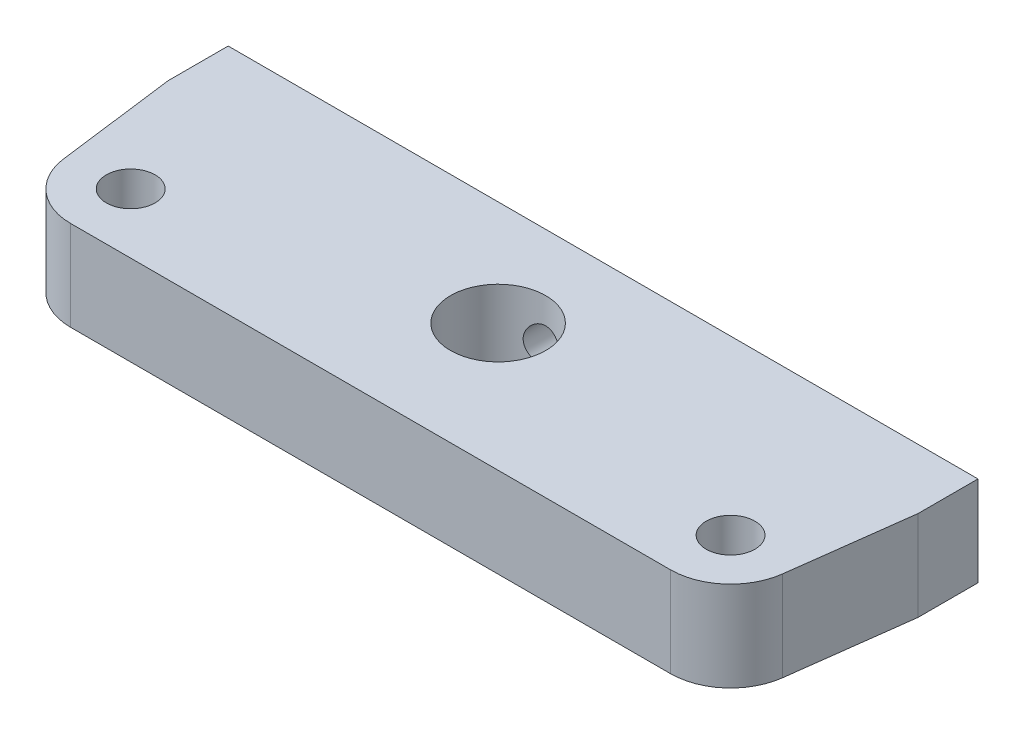
ISO-10303-21;
HEADER;
FILE_DESCRIPTION(('STEP AP214'),'2;1');
FILE_NAME('part.step','',(''),(''),'','','');
FILE_SCHEMA(('AUTOMOTIVE_DESIGN { 1 0 10303 214 1 1 1 1 }'));
ENDSEC;
DATA;
#1=APPLICATION_CONTEXT('core data for automotive mechanical design processes');
#2=APPLICATION_PROTOCOL_DEFINITION('international standard','automotive_design',2000,#1);
#3=PRODUCT_CONTEXT('',#1,'mechanical');
#4=PRODUCT('Part','Part','',(#3));
#5=PRODUCT_RELATED_PRODUCT_CATEGORY('part','',(#4));
#6=PRODUCT_DEFINITION_FORMATION('','',#4);
#7=PRODUCT_DEFINITION_CONTEXT('part definition',#1,'design');
#8=PRODUCT_DEFINITION('design','',#6,#7);
#9=PRODUCT_DEFINITION_SHAPE('','',#8);
#10=(LENGTH_UNIT() NAMED_UNIT(*) SI_UNIT(.MILLI.,.METRE.));
#11=(NAMED_UNIT(*) PLANE_ANGLE_UNIT() SI_UNIT($,.RADIAN.));
#12=(NAMED_UNIT(*) SI_UNIT($,.STERADIAN.) SOLID_ANGLE_UNIT());
#13=UNCERTAINTY_MEASURE_WITH_UNIT(LENGTH_MEASURE(1.E-05),#10,'distance_accuracy_value','');
#14=(GEOMETRIC_REPRESENTATION_CONTEXT(3) GLOBAL_UNCERTAINTY_ASSIGNED_CONTEXT((#13)) GLOBAL_UNIT_ASSIGNED_CONTEXT((#10,
#11,#12)) REPRESENTATION_CONTEXT('',''));
#15=CARTESIAN_POINT('',(0.,0.,0.));
#16=DIRECTION('',(0.,0.,1.));
#17=DIRECTION('',(1.,0.,0.));
#18=AXIS2_PLACEMENT_3D('',#15,#16,#17);
#19=CARTESIAN_POINT('',(40.,50.,-35.));
#20=DIRECTION('',(0.,1.,0.));
#21=DIRECTION('',(0.,0.,1.));
#22=AXIS2_PLACEMENT_3D('',#19,#20,#21);
#23=PLANE('',#22);
#24=CARTESIAN_POINT('',(-40.,50.,-35.));
#25=DIRECTION('',(0.,1.,0.));
#26=DIRECTION('',(0.,0.,1.));
#27=AXIS2_PLACEMENT_3D('',#24,#25,#26);
#28=CIRCLE('',#27,3.25);
#29=CARTESIAN_POINT('',(-40.,50.,-31.75));
#30=VERTEX_POINT('',#29);
#31=EDGE_CURVE('E195',#30,#30,#28,.T.);
#32=ORIENTED_EDGE('',*,*,#31,.F.);
#33=EDGE_LOOP('',(#32));
#34=FACE_BOUND('',#33,.T.);
#35=CARTESIAN_POINT('',(40.,50.,-35.));
#36=DIRECTION('',(0.,1.,0.));
#37=DIRECTION('',(0.,0.,1.));
#38=AXIS2_PLACEMENT_3D('',#35,#36,#37);
#39=CIRCLE('',#38,8.);
#40=CARTESIAN_POINT('',(40.,50.,-27.));
#41=VERTEX_POINT('',#40);
#42=CARTESIAN_POINT('',(47.934336401749,50.,-33.9771090655007));
#43=VERTEX_POINT('',#42);
#44=EDGE_CURVE('E157',#41,#43,#39,.T.);
#45=ORIENTED_EDGE('',*,*,#44,.T.);
#46=DIRECTION('',(0.127861366812416,0.,-0.991792050218624));
#47=VECTOR('',#46,1.);
#48=CARTESIAN_POINT('',(50.,50.,-50.));
#49=LINE('',#48,#47);
#50=CARTESIAN_POINT('',(50.,50.,-50.));
#51=VERTEX_POINT('',#50);
#52=EDGE_CURVE('E105',#43,#51,#49,.T.);
#53=ORIENTED_EDGE('',*,*,#52,.T.);
#54=DIRECTION('',(0.,0.,-1.));
#55=VECTOR('',#54,1.);
#56=CARTESIAN_POINT('',(50.,50.,-58.));
#57=LINE('',#56,#55);
#58=CARTESIAN_POINT('',(50.,50.,-58.));
#59=VERTEX_POINT('',#58);
#60=EDGE_CURVE('E173',#51,#59,#57,.T.);
#61=ORIENTED_EDGE('',*,*,#60,.T.);
#62=DIRECTION('',(-1.,0.,0.));
#63=VECTOR('',#62,1.);
#64=CARTESIAN_POINT('',(-50.,50.,-58.));
#65=LINE('',#64,#63);
#66=CARTESIAN_POINT('',(-50.,50.,-58.));
#67=VERTEX_POINT('',#66);
#68=EDGE_CURVE('E186',#59,#67,#65,.T.);
#69=ORIENTED_EDGE('',*,*,#68,.T.);
#70=DIRECTION('',(0.,0.,1.));
#71=VECTOR('',#70,1.);
#72=CARTESIAN_POINT('',(-50.,50.,-58.));
#73=LINE('',#72,#71);
#74=CARTESIAN_POINT('',(-50.,50.,-50.));
#75=VERTEX_POINT('',#74);
#76=EDGE_CURVE('E124',#67,#75,#73,.T.);
#77=ORIENTED_EDGE('',*,*,#76,.T.);
#78=DIRECTION('',(0.127861366812416,0.,0.991792050218624));
#79=VECTOR('',#78,1.);
#80=CARTESIAN_POINT('',(-50.,50.,-50.));
#81=LINE('',#80,#79);
#82=CARTESIAN_POINT('',(-47.934336401749,50.,-33.9771090655007));
#83=VERTEX_POINT('',#82);
#84=EDGE_CURVE('E118',#75,#83,#81,.T.);
#85=ORIENTED_EDGE('',*,*,#84,.T.);
#86=CARTESIAN_POINT('',(-40.,50.,-35.));
#87=DIRECTION('',(0.,1.,0.));
#88=DIRECTION('',(0.,0.,1.));
#89=AXIS2_PLACEMENT_3D('',#86,#87,#88);
#90=CIRCLE('',#89,8.);
#91=CARTESIAN_POINT('',(-40.,50.,-27.));
#92=VERTEX_POINT('',#91);
#93=EDGE_CURVE('E122',#83,#92,#90,.T.);
#94=ORIENTED_EDGE('',*,*,#93,.T.);
#95=DIRECTION('',(1.,0.,0.));
#96=VECTOR('',#95,1.);
#97=CARTESIAN_POINT('',(-40.,50.,-27.));
#98=LINE('',#97,#96);
#99=EDGE_CURVE('E62',#92,#41,#98,.T.);
#100=ORIENTED_EDGE('',*,*,#99,.T.);
#101=EDGE_LOOP('',(#45,#53,#61,#69,#77,#85,#94,#100));
#102=FACE_BOUND('',#101,.T.);
#103=CARTESIAN_POINT('',(0.,50.,-44.));
#104=DIRECTION('',(0.,1.,0.));
#105=DIRECTION('',(0.,0.,1.));
#106=AXIS2_PLACEMENT_3D('',#103,#104,#105);
#107=CIRCLE('',#106,6.35);
#108=CARTESIAN_POINT('',(0.,50.,-37.65));
#109=VERTEX_POINT('',#108);
#110=EDGE_CURVE('E146',#109,#109,#107,.T.);
#111=ORIENTED_EDGE('',*,*,#110,.F.);
#112=EDGE_LOOP('',(#111));
#113=FACE_BOUND('',#112,.T.);
#114=CARTESIAN_POINT('',(40.,50.,-35.));
#115=DIRECTION('',(0.,1.,0.));
#116=DIRECTION('',(0.,0.,1.));
#117=AXIS2_PLACEMENT_3D('',#114,#115,#116);
#118=CIRCLE('',#117,3.25);
#119=CARTESIAN_POINT('',(40.,50.,-31.75));
#120=VERTEX_POINT('',#119);
#121=EDGE_CURVE('E201',#120,#120,#118,.T.);
#122=ORIENTED_EDGE('',*,*,#121,.F.);
#123=EDGE_LOOP('',(#122));
#124=FACE_BOUND('',#123,.T.);
#125=ADVANCED_FACE('F39',(#34,#102,#113,#124),#23,.T.);
#126=CARTESIAN_POINT('',(40.,38.,-35.));
#127=DIRECTION('',(0.,1.,0.));
#128=DIRECTION('',(0.,0.,1.));
#129=AXIS2_PLACEMENT_3D('',#126,#127,#128);
#130=PLANE('',#129);
#131=CARTESIAN_POINT('',(40.,38.,-35.));
#132=DIRECTION('',(0.,1.,0.));
#133=DIRECTION('',(0.,0.,1.));
#134=AXIS2_PLACEMENT_3D('',#131,#132,#133);
#135=CIRCLE('',#134,8.);
#136=CARTESIAN_POINT('',(40.,38.,-27.));
#137=VERTEX_POINT('',#136);
#138=CARTESIAN_POINT('',(47.934336401749,38.,-33.9771090655007));
#139=VERTEX_POINT('',#138);
#140=EDGE_CURVE('E142',#137,#139,#135,.T.);
#141=ORIENTED_EDGE('',*,*,#140,.F.);
#142=DIRECTION('',(1.,0.,0.));
#143=VECTOR('',#142,1.);
#144=CARTESIAN_POINT('',(-40.,38.,-27.));
#145=LINE('',#144,#143);
#146=CARTESIAN_POINT('',(-40.,38.,-27.));
#147=VERTEX_POINT('',#146);
#148=EDGE_CURVE('E97',#147,#137,#145,.T.);
#149=ORIENTED_EDGE('',*,*,#148,.F.);
#150=CARTESIAN_POINT('',(-40.,38.,-35.));
#151=DIRECTION('',(0.,1.,0.));
#152=DIRECTION('',(0.,0.,1.));
#153=AXIS2_PLACEMENT_3D('',#150,#151,#152);
#154=CIRCLE('',#153,8.);
#155=CARTESIAN_POINT('',(-47.934336401749,38.,-33.9771090655007));
#156=VERTEX_POINT('',#155);
#157=EDGE_CURVE('E91',#156,#147,#154,.T.);
#158=ORIENTED_EDGE('',*,*,#157,.F.);
#159=DIRECTION('',(0.127861366812416,0.,0.991792050218624));
#160=VECTOR('',#159,1.);
#161=CARTESIAN_POINT('',(-50.,38.,-50.));
#162=LINE('',#161,#160);
#163=CARTESIAN_POINT('',(-50.,38.,-50.));
#164=VERTEX_POINT('',#163);
#165=EDGE_CURVE('E132',#164,#156,#162,.T.);
#166=ORIENTED_EDGE('',*,*,#165,.F.);
#167=DIRECTION('',(0.,0.,1.));
#168=VECTOR('',#167,1.);
#169=CARTESIAN_POINT('',(-50.,38.,-58.));
#170=LINE('',#169,#168);
#171=CARTESIAN_POINT('',(-50.,38.,-58.));
#172=VERTEX_POINT('',#171);
#173=EDGE_CURVE('E152',#172,#164,#170,.T.);
#174=ORIENTED_EDGE('',*,*,#173,.F.);
#175=DIRECTION('',(-1.,0.,0.));
#176=VECTOR('',#175,1.);
#177=CARTESIAN_POINT('',(-50.,38.,-58.));
#178=LINE('',#177,#176);
#179=CARTESIAN_POINT('',(50.,38.,-58.));
#180=VERTEX_POINT('',#179);
#181=EDGE_CURVE('E150',#180,#172,#178,.T.);
#182=ORIENTED_EDGE('',*,*,#181,.F.);
#183=DIRECTION('',(0.,0.,-1.));
#184=VECTOR('',#183,1.);
#185=CARTESIAN_POINT('',(50.,38.,-58.));
#186=LINE('',#185,#184);
#187=CARTESIAN_POINT('',(50.,38.,-50.));
#188=VERTEX_POINT('',#187);
#189=EDGE_CURVE('E148',#188,#180,#186,.T.);
#190=ORIENTED_EDGE('',*,*,#189,.F.);
#191=DIRECTION('',(0.127861366812416,0.,-0.991792050218624));
#192=VECTOR('',#191,1.);
#193=CARTESIAN_POINT('',(50.,38.,-50.));
#194=LINE('',#193,#192);
#195=EDGE_CURVE('E145',#139,#188,#194,.T.);
#196=ORIENTED_EDGE('',*,*,#195,.F.);
#197=EDGE_LOOP('',(#141,#149,#158,#166,#174,#182,#190,#196));
#198=FACE_BOUND('',#197,.T.);
#199=CARTESIAN_POINT('',(0.,38.,-44.));
#200=DIRECTION('',(0.,1.,0.));
#201=DIRECTION('',(0.,0.,1.));
#202=AXIS2_PLACEMENT_3D('',#199,#200,#201);
#203=CIRCLE('',#202,6.35);
#204=CARTESIAN_POINT('',(0.,38.,-37.65));
#205=VERTEX_POINT('',#204);
#206=EDGE_CURVE('E192',#205,#205,#203,.T.);
#207=ORIENTED_EDGE('',*,*,#206,.T.);
#208=EDGE_LOOP('',(#207));
#209=FACE_BOUND('',#208,.T.);
#210=CARTESIAN_POINT('',(-40.,38.,-35.));
#211=DIRECTION('',(0.,1.,0.));
#212=DIRECTION('',(0.,0.,1.));
#213=AXIS2_PLACEMENT_3D('',#210,#211,#212);
#214=CIRCLE('',#213,3.25);
#215=CARTESIAN_POINT('',(-40.,38.,-31.75));
#216=VERTEX_POINT('',#215);
#217=EDGE_CURVE('E198',#216,#216,#214,.T.);
#218=ORIENTED_EDGE('',*,*,#217,.T.);
#219=EDGE_LOOP('',(#218));
#220=FACE_BOUND('',#219,.T.);
#221=CARTESIAN_POINT('',(40.,38.,-35.));
#222=DIRECTION('',(0.,1.,0.));
#223=DIRECTION('',(0.,0.,1.));
#224=AXIS2_PLACEMENT_3D('',#221,#222,#223);
#225=CIRCLE('',#224,3.25);
#226=CARTESIAN_POINT('',(40.,38.,-31.75));
#227=VERTEX_POINT('',#226);
#228=EDGE_CURVE('E204',#227,#227,#225,.T.);
#229=ORIENTED_EDGE('',*,*,#228,.T.);
#230=EDGE_LOOP('',(#229));
#231=FACE_BOUND('',#230,.T.);
#232=ADVANCED_FACE('F177',(#198,#209,#220,#231),#130,.F.);
#233=CARTESIAN_POINT('',(40.,50.,-35.));
#234=DIRECTION('',(0.,-1.,0.));
#235=DIRECTION('',(0.,0.,-1.));
#236=AXIS2_PLACEMENT_3D('',#233,#234,#235);
#237=CYLINDRICAL_SURFACE('',#236,8.);
#238=ORIENTED_EDGE('',*,*,#140,.T.);
#239=DIRECTION('',(0.,-1.,0.));
#240=VECTOR('',#239,1.);
#241=CARTESIAN_POINT('',(47.934336401749,50.,-33.9771090655007));
#242=LINE('',#241,#240);
#243=EDGE_CURVE('E11',#43,#139,#242,.T.);
#244=ORIENTED_EDGE('',*,*,#243,.F.);
#245=ORIENTED_EDGE('',*,*,#44,.F.);
#246=DIRECTION('',(0.,-1.,0.));
#247=VECTOR('',#246,1.);
#248=CARTESIAN_POINT('',(40.,50.,-27.));
#249=LINE('',#248,#247);
#250=EDGE_CURVE('E138',#41,#137,#249,.T.);
#251=ORIENTED_EDGE('',*,*,#250,.T.);
#252=EDGE_LOOP('',(#238,#244,#245,#251));
#253=FACE_BOUND('',#252,.T.);
#254=ADVANCED_FACE('F41',(#253),#237,.T.);
#255=CARTESIAN_POINT('',(50.,50.,-50.));
#256=DIRECTION('',(-0.991792050218623,0.,-0.127861366812416));
#257=DIRECTION('',(-0.127861366812416,0.,0.991792050218624));
#258=AXIS2_PLACEMENT_3D('',#255,#256,#257);
#259=PLANE('',#258);
#260=ORIENTED_EDGE('',*,*,#195,.T.);
#261=DIRECTION('',(0.,-1.,0.));
#262=VECTOR('',#261,1.);
#263=CARTESIAN_POINT('',(50.,50.,-50.));
#264=LINE('',#263,#262);
#265=EDGE_CURVE('E54',#51,#188,#264,.T.);
#266=ORIENTED_EDGE('',*,*,#265,.F.);
#267=ORIENTED_EDGE('',*,*,#52,.F.);
#268=ORIENTED_EDGE('',*,*,#243,.T.);
#269=EDGE_LOOP('',(#260,#266,#267,#268));
#270=FACE_BOUND('',#269,.T.);
#271=ADVANCED_FACE('F274',(#270),#259,.F.);
#272=CARTESIAN_POINT('',(50.,50.,-58.));
#273=DIRECTION('',(-1.,0.,0.));
#274=DIRECTION('',(0.,0.,1.));
#275=AXIS2_PLACEMENT_3D('',#272,#273,#274);
#276=PLANE('',#275);
#277=ORIENTED_EDGE('',*,*,#189,.T.);
#278=DIRECTION('',(0.,-1.,0.));
#279=VECTOR('',#278,1.);
#280=CARTESIAN_POINT('',(50.,50.,-58.));
#281=LINE('',#280,#279);
#282=EDGE_CURVE('E164',#59,#180,#281,.T.);
#283=ORIENTED_EDGE('',*,*,#282,.F.);
#284=ORIENTED_EDGE('',*,*,#60,.F.);
#285=ORIENTED_EDGE('',*,*,#265,.T.);
#286=EDGE_LOOP('',(#277,#283,#284,#285));
#287=FACE_BOUND('',#286,.T.);
#288=ADVANCED_FACE('F171',(#287),#276,.F.);
#289=CARTESIAN_POINT('',(-50.,50.,-58.));
#290=DIRECTION('',(0.,0.,1.));
#291=DIRECTION('',(1.,0.,0.));
#292=AXIS2_PLACEMENT_3D('',#289,#290,#291);
#293=PLANE('',#292);
#294=CARTESIAN_POINT('',(40.,44.,-58.));
#295=DIRECTION('',(0.,0.,-1.));
#296=DIRECTION('',(-1.,0.,0.));
#297=AXIS2_PLACEMENT_3D('',#294,#295,#296);
#298=CIRCLE('',#297,2.5);
#299=CARTESIAN_POINT('',(37.5,44.,-58.));
#300=VERTEX_POINT('',#299);
#301=EDGE_CURVE('E213',#300,#300,#298,.T.);
#302=ORIENTED_EDGE('',*,*,#301,.F.);
#303=EDGE_LOOP('',(#302));
#304=FACE_BOUND('',#303,.T.);
#305=CARTESIAN_POINT('',(-40.,44.,-58.));
#306=DIRECTION('',(0.,0.,-1.));
#307=DIRECTION('',(-1.,0.,0.));
#308=AXIS2_PLACEMENT_3D('',#305,#306,#307);
#309=CIRCLE('',#308,2.5);
#310=CARTESIAN_POINT('',(-42.5,44.,-58.));
#311=VERTEX_POINT('',#310);
#312=EDGE_CURVE('E219',#311,#311,#309,.T.);
#313=ORIENTED_EDGE('',*,*,#312,.F.);
#314=EDGE_LOOP('',(#313));
#315=FACE_BOUND('',#314,.T.);
#316=CARTESIAN_POINT('',(0.,44.,-58.));
#317=DIRECTION('',(0.,0.,-1.));
#318=DIRECTION('',(-1.,0.,0.));
#319=AXIS2_PLACEMENT_3D('',#316,#317,#318);
#320=CIRCLE('',#319,2.5);
#321=CARTESIAN_POINT('',(-2.5,44.,-58.));
#322=VERTEX_POINT('',#321);
#323=EDGE_CURVE('E209',#322,#322,#320,.T.);
#324=ORIENTED_EDGE('',*,*,#323,.F.);
#325=EDGE_LOOP('',(#324));
#326=FACE_BOUND('',#325,.T.);
#327=ORIENTED_EDGE('',*,*,#181,.T.);
#328=DIRECTION('',(0.,-1.,0.));
#329=VECTOR('',#328,1.);
#330=CARTESIAN_POINT('',(-50.,50.,-58.));
#331=LINE('',#330,#329);
#332=EDGE_CURVE('E161',#67,#172,#331,.T.);
#333=ORIENTED_EDGE('',*,*,#332,.F.);
#334=ORIENTED_EDGE('',*,*,#68,.F.);
#335=ORIENTED_EDGE('',*,*,#282,.T.);
#336=EDGE_LOOP('',(#327,#333,#334,#335));
#337=FACE_BOUND('',#336,.T.);
#338=ADVANCED_FACE('F182',(#304,#315,#326,#337),#293,.F.);
#339=CARTESIAN_POINT('',(-50.,50.,-58.));
#340=DIRECTION('',(1.,0.,0.));
#341=DIRECTION('',(0.,0.,-1.));
#342=AXIS2_PLACEMENT_3D('',#339,#340,#341);
#343=PLANE('',#342);
#344=ORIENTED_EDGE('',*,*,#173,.T.);
#345=DIRECTION('',(0.,-1.,0.));
#346=VECTOR('',#345,1.);
#347=CARTESIAN_POINT('',(-50.,50.,-50.));
#348=LINE('',#347,#346);
#349=EDGE_CURVE('E133',#75,#164,#348,.T.);
#350=ORIENTED_EDGE('',*,*,#349,.F.);
#351=ORIENTED_EDGE('',*,*,#76,.F.);
#352=ORIENTED_EDGE('',*,*,#332,.T.);
#353=EDGE_LOOP('',(#344,#350,#351,#352));
#354=FACE_BOUND('',#353,.T.);
#355=ADVANCED_FACE('F185',(#354),#343,.F.);
#356=CARTESIAN_POINT('',(-50.,50.,-50.));
#357=DIRECTION('',(0.991792050218623,0.,-0.127861366812416));
#358=DIRECTION('',(-0.127861366812416,0.,-0.991792050218624));
#359=AXIS2_PLACEMENT_3D('',#356,#357,#358);
#360=PLANE('',#359);
#361=ORIENTED_EDGE('',*,*,#165,.T.);
#362=DIRECTION('',(0.,-1.,0.));
#363=VECTOR('',#362,1.);
#364=CARTESIAN_POINT('',(-47.934336401749,50.,-33.9771090655007));
#365=LINE('',#364,#363);
#366=EDGE_CURVE('E129',#83,#156,#365,.T.);
#367=ORIENTED_EDGE('',*,*,#366,.F.);
#368=ORIENTED_EDGE('',*,*,#84,.F.);
#369=ORIENTED_EDGE('',*,*,#349,.T.);
#370=EDGE_LOOP('',(#361,#367,#368,#369));
#371=FACE_BOUND('',#370,.T.);
#372=ADVANCED_FACE('F130',(#371),#360,.F.);
#373=CARTESIAN_POINT('',(-40.,50.,-35.));
#374=DIRECTION('',(0.,-1.,0.));
#375=DIRECTION('',(0.,0.,-1.));
#376=AXIS2_PLACEMENT_3D('',#373,#374,#375);
#377=CYLINDRICAL_SURFACE('',#376,8.);
#378=ORIENTED_EDGE('',*,*,#157,.T.);
#379=DIRECTION('',(0.,-1.,0.));
#380=VECTOR('',#379,1.);
#381=CARTESIAN_POINT('',(-40.,50.,-27.));
#382=LINE('',#381,#380);
#383=EDGE_CURVE('E134',#92,#147,#382,.T.);
#384=ORIENTED_EDGE('',*,*,#383,.F.);
#385=ORIENTED_EDGE('',*,*,#93,.F.);
#386=ORIENTED_EDGE('',*,*,#366,.T.);
#387=EDGE_LOOP('',(#378,#384,#385,#386));
#388=FACE_BOUND('',#387,.T.);
#389=ADVANCED_FACE('F136',(#388),#377,.T.);
#390=CARTESIAN_POINT('',(-40.,50.,-27.));
#391=DIRECTION('',(0.,0.,-1.));
#392=DIRECTION('',(-1.,0.,0.));
#393=AXIS2_PLACEMENT_3D('',#390,#391,#392);
#394=PLANE('',#393);
#395=ORIENTED_EDGE('',*,*,#148,.T.);
#396=ORIENTED_EDGE('',*,*,#250,.F.);
#397=ORIENTED_EDGE('',*,*,#99,.F.);
#398=ORIENTED_EDGE('',*,*,#383,.T.);
#399=EDGE_LOOP('',(#395,#396,#397,#398));
#400=FACE_BOUND('',#399,.T.);
#401=ADVANCED_FACE('F264',(#400),#394,.F.);
#402=CARTESIAN_POINT('',(0.,50.,-44.));
#403=DIRECTION('',(0.,-1.,0.));
#404=DIRECTION('',(0.,0.,-1.));
#405=AXIS2_PLACEMENT_3D('',#402,#403,#404);
#406=CYLINDRICAL_SURFACE('',#405,6.35);
#407=CARTESIAN_POINT('',(0.,46.5,-50.35));
#408=CARTESIAN_POINT('',(-0.134553966169354,46.4999950049564,-50.3499961745986));
#409=CARTESIAN_POINT('',(-0.269336571174967,46.4890751557637,-50.3456746623718));
#410=CARTESIAN_POINT('',(-0.535088905639055,46.4457905952238,-50.328823357126));
#411=CARTESIAN_POINT('',(-0.666048004448621,46.4133711213123,-50.3162726039992));
#412=CARTESIAN_POINT('',(-0.919914813168561,46.328434670697,-50.2843115930375));
#413=CARTESIAN_POINT('',(-1.04284652175185,46.2759811437113,-50.2649230059667));
#414=CARTESIAN_POINT('',(-1.27806359095825,46.1527180152143,-50.2212043454676));
#415=CARTESIAN_POINT('',(-1.39035218812232,46.0819140186473,-50.1968757813902));
#416=CARTESIAN_POINT('',(-1.60639851936583,45.920524683543,-50.1444979821366));
#417=CARTESIAN_POINT('',(-1.70960334693636,45.8292361026491,-50.1163357193309));
#418=CARTESIAN_POINT('',(-1.89970207687357,45.6309538296745,-50.0599902608516));
#419=CARTESIAN_POINT('',(-1.98658846210173,45.5239529399151,-50.0318070615057));
#420=CARTESIAN_POINT('',(-2.14524488686995,45.2917151987723,-49.977271453558));
#421=CARTESIAN_POINT('',(-2.2162084253797,45.1658937121067,-49.9510490975474));
#422=CARTESIAN_POINT('',(-2.33571898850402,44.902911943275,-49.9051710759617));
#423=CARTESIAN_POINT('',(-2.38427625190024,44.7657568739592,-49.8855124121765));
#424=CARTESIAN_POINT('',(-2.45537613995342,44.4903508494304,-49.8561981222935));
#425=CARTESIAN_POINT('',(-2.47897530665884,44.3524172333414,-49.8461381749116));
#426=CARTESIAN_POINT('',(-2.50279043279639,44.0742092264709,-49.8359853521153));
#427=CARTESIAN_POINT('',(-2.50301741528153,43.9339359703588,-49.8358877781342));
#428=CARTESIAN_POINT('',(-2.48088430587097,43.6650547077634,-49.8453248302998));
#429=CARTESIAN_POINT('',(-2.46003752778908,43.5362951322367,-49.8542141111358));
#430=CARTESIAN_POINT('',(-2.39886638306082,43.2842758587167,-49.8795428672068));
#431=CARTESIAN_POINT('',(-2.35853873302629,43.1610170916798,-49.8959836151749));
#432=CARTESIAN_POINT('',(-2.25879178559437,42.9205810024347,-49.9349191098582));
#433=CARTESIAN_POINT('',(-2.19900587681632,42.8035751860298,-49.9575286410377));
#434=CARTESIAN_POINT('',(-2.0622963800787,42.5808363361866,-50.0062208994744));
#435=CARTESIAN_POINT('',(-1.98536648440861,42.4751074730521,-50.0323049036543));
#436=CARTESIAN_POINT('',(-1.80979694623541,42.2696155241556,-50.0873805687355));
#437=CARTESIAN_POINT('',(-1.70996507725302,42.1708875988427,-50.1164439013913));
#438=CARTESIAN_POINT('',(-1.49484520138701,41.9912495741734,-50.1725426749669));
#439=CARTESIAN_POINT('',(-1.37955431153591,41.9103428057571,-50.1995777361623));
#440=CARTESIAN_POINT('',(-1.13392939532751,41.76734229979,-50.2492135352106));
#441=CARTESIAN_POINT('',(-1.00335545974232,41.7056264607627,-50.2717224451784));
#442=CARTESIAN_POINT('',(-0.732568757301268,41.6053899460577,-50.3090790857174));
#443=CARTESIAN_POINT('',(-0.592360766197814,41.5668578689403,-50.3239305815794));
#444=CARTESIAN_POINT('',(-0.314971963627263,41.5161494695432,-50.3436190816197));
#445=CARTESIAN_POINT('',(-0.178082917418503,41.50258130377,-50.348984250052));
#446=CARTESIAN_POINT('',(0.0961072640949453,41.4980907416084,-50.3507511802806));
#447=CARTESIAN_POINT('',(0.233408288149806,41.507162700082,-50.3471551764754));
#448=CARTESIAN_POINT('',(0.498292224086758,41.5466622025234,-50.3317503868538));
#449=CARTESIAN_POINT('',(0.626038654697898,41.5761495639312,-50.3203033701842));
#450=CARTESIAN_POINT('',(0.874660095981653,41.6543742319493,-50.2907197153771));
#451=CARTESIAN_POINT('',(0.995534217770085,41.7031140222739,-50.2725822141346));
#452=CARTESIAN_POINT('',(1.23110128938448,41.8200444521159,-50.2307016650676));
#453=CARTESIAN_POINT('',(1.34549548641504,41.8887803030612,-50.2068052576378));
#454=CARTESIAN_POINT('',(1.56152383451872,42.0431441471455,-50.156011520259));
#455=CARTESIAN_POINT('',(1.66315293821618,42.128778787948,-50.129113011155));
#456=CARTESIAN_POINT('',(1.85758269622987,42.320940685094,-50.0731187799717));
#457=CARTESIAN_POINT('',(1.9494024550278,42.4284541282674,-50.0439925898536));
#458=CARTESIAN_POINT('',(2.1139256988637,42.657894500357,-49.9884371034208));
#459=CARTESIAN_POINT('',(2.18662643847839,42.7798234956553,-49.9620081947592));
#460=CARTESIAN_POINT('',(2.31119994331426,43.0362445072933,-49.9148414930221));
#461=CARTESIAN_POINT('',(2.3628981425998,43.1708308081313,-49.8941518349479));
#462=CARTESIAN_POINT('',(2.44251241444137,43.4478548094581,-49.8616139557908));
#463=CARTESIAN_POINT('',(2.47044528419831,43.5902868886552,-49.8497594907794));
#464=CARTESIAN_POINT('',(2.5001560817428,43.868211889923,-49.837118804557));
#465=CARTESIAN_POINT('',(2.50362861133498,44.0034922692523,-49.8356156279887));
#466=CARTESIAN_POINT('',(2.48874240848287,44.2726084404769,-49.841979655313));
#467=CARTESIAN_POINT('',(2.47038624697604,44.4064444006197,-49.8498457557121));
#468=CARTESIAN_POINT('',(2.4137318242914,44.6637958562813,-49.8734385087458));
#469=CARTESIAN_POINT('',(2.37619878243832,44.7875100297439,-49.8888626675542));
#470=CARTESIAN_POINT('',(2.28296099085996,45.0269403587713,-49.9256297128435));
#471=CARTESIAN_POINT('',(2.22725144389621,45.142654393116,-49.9469741616151));
#472=CARTESIAN_POINT('',(2.09562924514573,45.3698650669459,-49.9946637280408));
#473=CARTESIAN_POINT('',(2.01875899704479,45.4807615112271,-50.0212221202971));
#474=CARTESIAN_POINT('',(1.84841299459082,45.6886202572178,-50.0756775147592));
#475=CARTESIAN_POINT('',(1.75493144142049,45.7855776715191,-50.1035749819304));
#476=CARTESIAN_POINT('',(1.5471064695902,45.9689681894365,-50.15964587367));
#477=CARTESIAN_POINT('',(1.43182793668255,46.0543735925985,-50.1877288181631));
#478=CARTESIAN_POINT('',(1.18753251019108,46.2046111272694,-50.2392157314777));
#479=CARTESIAN_POINT('',(1.05851379088707,46.269440520185,-50.2626190773081));
#480=CARTESIAN_POINT('',(0.801712000574562,46.3716484853223,-50.3004095707815));
#481=CARTESIAN_POINT('',(0.674756215325959,46.4108921084602,-50.31539404397));
#482=CARTESIAN_POINT('',(0.415787686623073,46.4687302524382,-50.3376970595587));
#483=CARTESIAN_POINT('',(0.283789884654928,46.4873815268315,-50.3450366684114));
#484=CARTESIAN_POINT('',(0.126085882756387,46.4969467777404,-50.3487987371088));
#485=CARTESIAN_POINT('',(0.100887023550413,46.4980908694645,-50.3492485722676));
#486=CARTESIAN_POINT('',(0.0504614577838964,46.499617969314,-50.3498495704044));
#487=CARTESIAN_POINT('',(0.0252347498079838,46.500000936789,-50.35000071743));
#488=CARTESIAN_POINT('',(0.,46.5,-50.35));
#489=B_SPLINE_CURVE_WITH_KNOTS('',3,(#407,#408,#409,#410,#411,#412,#413,#414,#415,#416,#417,
#418,#419,#420,#421,#422,#423,#424,#425,#426,#427,#428,#429,#430,#431,#432,#433,#434,#435,#436,
#437,#438,#439,#440,#441,#442,#443,#444,#445,#446,#447,#448,#449,#450,#451,#452,#453,#454,#455,
#456,#457,#458,#459,#460,#461,#462,#463,#464,#465,#466,#467,#468,#469,#470,#471,#472,#473,#474,
#475,#476,#477,#478,#479,#480,#481,#482,#483,#484,#485,#486,#487,#488),.UNSPECIFIED.,.T.,.F.,(4,
2,2,2,2,2,2,2,2,2,2,2,2,2,2,2,2,2,2,2,2,2,2,2,2,2,2,2,2,2,2,2,2,2,2,2,2,2,2,2,4),(0.,
0.403558875489098,0.808149640616258,1.21146951410153,1.61466634295684,2.03471952872487,
2.45496574116262,2.89320518926667,3.33124418047491,3.74989041671429,4.16833920539152,
4.55873339731187,4.94919341088218,5.34748294469489,5.7459192620459,6.17411035489119,
6.60238141285148,7.03861803074871,7.47463993804279,7.88551530365009,8.29628823093429,
8.68930295059461,9.08236838880241,9.48735796439885,9.89250717394582,10.3235785470975,
10.7547117868103,11.1893585465848,11.623697844666,12.0276211501451,12.4314968870954,
12.8203869038963,13.2093796417258,13.620181819931,14.0311276872341,14.4675975397313,
14.9041254604669,15.303545225982,15.701861401018,15.7775422872301,15.8532272153351),.UNSPECIFIED.);
#490=CARTESIAN_POINT('',(0.,46.5,-50.35));
#491=VERTEX_POINT('',#490);
#492=EDGE_CURVE('E43',#491,#491,#489,.T.);
#493=ORIENTED_EDGE('',*,*,#492,.F.);
#494=EDGE_LOOP('',(#493));
#495=FACE_BOUND('',#494,.T.);
#496=ORIENTED_EDGE('',*,*,#110,.T.);
#497=EDGE_LOOP('',(#496));
#498=FACE_BOUND('',#497,.T.);
#499=ORIENTED_EDGE('',*,*,#206,.F.);
#500=EDGE_LOOP('',(#499));
#501=FACE_BOUND('',#500,.T.);
#502=ADVANCED_FACE('F260',(#495,#498,#501),#406,.F.);
#503=CARTESIAN_POINT('',(-40.,50.,-35.));
#504=DIRECTION('',(0.,-1.,0.));
#505=DIRECTION('',(0.,0.,-1.));
#506=AXIS2_PLACEMENT_3D('',#503,#504,#505);
#507=CYLINDRICAL_SURFACE('',#506,3.25);
#508=ORIENTED_EDGE('',*,*,#31,.T.);
#509=EDGE_LOOP('',(#508));
#510=FACE_BOUND('',#509,.T.);
#511=ORIENTED_EDGE('',*,*,#217,.F.);
#512=EDGE_LOOP('',(#511));
#513=FACE_BOUND('',#512,.T.);
#514=ADVANCED_FACE('F246',(#510,#513),#507,.F.);
#515=CARTESIAN_POINT('',(40.,50.,-35.));
#516=DIRECTION('',(0.,-1.,0.));
#517=DIRECTION('',(0.,0.,-1.));
#518=AXIS2_PLACEMENT_3D('',#515,#516,#517);
#519=CYLINDRICAL_SURFACE('',#518,3.25);
#520=ORIENTED_EDGE('',*,*,#121,.T.);
#521=EDGE_LOOP('',(#520));
#522=FACE_BOUND('',#521,.T.);
#523=ORIENTED_EDGE('',*,*,#228,.F.);
#524=EDGE_LOOP('',(#523));
#525=FACE_BOUND('',#524,.T.);
#526=ADVANCED_FACE('F241',(#522,#525),#519,.F.);
#527=CARTESIAN_POINT('',(0.,44.,-48.));
#528=DIRECTION('',(0.,0.,-1.));
#529=DIRECTION('',(-1.,0.,0.));
#530=AXIS2_PLACEMENT_3D('',#527,#528,#529);
#531=CYLINDRICAL_SURFACE('',#530,2.5);
#532=ORIENTED_EDGE('',*,*,#492,.T.);
#533=EDGE_LOOP('',(#532));
#534=FACE_BOUND('',#533,.T.);
#535=ORIENTED_EDGE('',*,*,#323,.T.);
#536=EDGE_LOOP('',(#535));
#537=FACE_BOUND('',#536,.T.);
#538=ADVANCED_FACE('F230',(#534,#537),#531,.F.);
#539=CARTESIAN_POINT('',(-40.,44.,-48.));
#540=DIRECTION('',(0.,0.,-1.));
#541=DIRECTION('',(-1.,0.,0.));
#542=AXIS2_PLACEMENT_3D('',#539,#540,#541);
#543=CYLINDRICAL_SURFACE('',#542,2.5);
#544=CARTESIAN_POINT('',(-40.,44.,-48.));
#545=DIRECTION('',(0.,0.,-1.));
#546=DIRECTION('',(-1.,0.,0.));
#547=AXIS2_PLACEMENT_3D('',#544,#545,#546);
#548=CIRCLE('',#547,2.5);
#549=CARTESIAN_POINT('',(-42.5,44.,-48.));
#550=VERTEX_POINT('',#549);
#551=EDGE_CURVE('E212',#550,#550,#548,.T.);
#552=ORIENTED_EDGE('',*,*,#551,.F.);
#553=EDGE_LOOP('',(#552));
#554=FACE_BOUND('',#553,.T.);
#555=ORIENTED_EDGE('',*,*,#312,.T.);
#556=EDGE_LOOP('',(#555));
#557=FACE_BOUND('',#556,.T.);
#558=ADVANCED_FACE('F227',(#554,#557),#543,.F.);
#559=CARTESIAN_POINT('',(-40.,44.,-48.));
#560=DIRECTION('',(0.,0.,-1.));
#561=DIRECTION('',(-1.,0.,0.));
#562=AXIS2_PLACEMENT_3D('',#559,#560,#561);
#563=PLANE('',#562);
#564=ORIENTED_EDGE('',*,*,#551,.T.);
#565=EDGE_LOOP('',(#564));
#566=FACE_BOUND('',#565,.T.);
#567=ADVANCED_FACE('F225',(#566),#563,.T.);
#568=CARTESIAN_POINT('',(40.,44.,-48.));
#569=DIRECTION('',(0.,0.,-1.));
#570=DIRECTION('',(-1.,0.,0.));
#571=AXIS2_PLACEMENT_3D('',#568,#569,#570);
#572=CYLINDRICAL_SURFACE('',#571,2.5);
#573=CARTESIAN_POINT('',(40.,44.,-48.));
#574=DIRECTION('',(0.,0.,-1.));
#575=DIRECTION('',(-1.,0.,0.));
#576=AXIS2_PLACEMENT_3D('',#573,#574,#575);
#577=CIRCLE('',#576,2.5);
#578=CARTESIAN_POINT('',(37.5,44.,-48.));
#579=VERTEX_POINT('',#578);
#580=EDGE_CURVE('E216',#579,#579,#577,.T.);
#581=ORIENTED_EDGE('',*,*,#580,.F.);
#582=EDGE_LOOP('',(#581));
#583=FACE_BOUND('',#582,.T.);
#584=ORIENTED_EDGE('',*,*,#301,.T.);
#585=EDGE_LOOP('',(#584));
#586=FACE_BOUND('',#585,.T.);
#587=ADVANCED_FACE('F366',(#583,#586),#572,.F.);
#588=CARTESIAN_POINT('',(40.,44.,-48.));
#589=DIRECTION('',(0.,0.,-1.));
#590=DIRECTION('',(-1.,0.,0.));
#591=AXIS2_PLACEMENT_3D('',#588,#589,#590);
#592=PLANE('',#591);
#593=ORIENTED_EDGE('',*,*,#580,.T.);
#594=EDGE_LOOP('',(#593));
#595=FACE_BOUND('',#594,.T.);
#596=ADVANCED_FACE('F374',(#595),#592,.T.);
#597=CLOSED_SHELL('',(#125,#232,#254,#271,#288,#338,#355,#372,#389,#401,#502,#514,#526,#538,
#558,#567,#587,#596));
#598=MANIFOLD_SOLID_BREP('B2',#597);
#599=ADVANCED_BREP_SHAPE_REPRESENTATION('',(#18,#598),#14);
#600=SHAPE_DEFINITION_REPRESENTATION(#9,#599);
ENDSEC;
END-ISO-10303-21;
